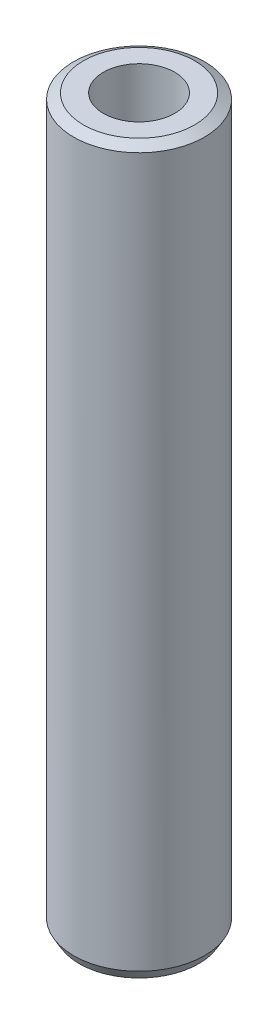
ISO-10303-21;
HEADER;
FILE_DESCRIPTION(('STEP AP214'),'2;1');
FILE_NAME('part.step','',(''),(''),'','','');
FILE_SCHEMA(('AUTOMOTIVE_DESIGN { 1 0 10303 214 1 1 1 1 }'));
ENDSEC;
DATA;
#1=APPLICATION_CONTEXT('core data for automotive mechanical design processes');
#2=APPLICATION_PROTOCOL_DEFINITION('international standard','automotive_design',2000,#1);
#3=PRODUCT_CONTEXT('',#1,'mechanical');
#4=PRODUCT('Part','Part','',(#3));
#5=PRODUCT_RELATED_PRODUCT_CATEGORY('part','',(#4));
#6=PRODUCT_DEFINITION_FORMATION('','',#4);
#7=PRODUCT_DEFINITION_CONTEXT('part definition',#1,'design');
#8=PRODUCT_DEFINITION('design','',#6,#7);
#9=PRODUCT_DEFINITION_SHAPE('','',#8);
#10=(LENGTH_UNIT() NAMED_UNIT(*) SI_UNIT(.MILLI.,.METRE.));
#11=(NAMED_UNIT(*) PLANE_ANGLE_UNIT() SI_UNIT($,.RADIAN.));
#12=(NAMED_UNIT(*) SI_UNIT($,.STERADIAN.) SOLID_ANGLE_UNIT());
#13=UNCERTAINTY_MEASURE_WITH_UNIT(LENGTH_MEASURE(1.E-05),#10,'distance_accuracy_value','');
#14=(GEOMETRIC_REPRESENTATION_CONTEXT(3) GLOBAL_UNCERTAINTY_ASSIGNED_CONTEXT((#13)) GLOBAL_UNIT_ASSIGNED_CONTEXT((#10,
#11,#12)) REPRESENTATION_CONTEXT('',''));
#15=CARTESIAN_POINT('',(0.,0.,0.));
#16=DIRECTION('',(0.,0.,1.));
#17=DIRECTION('',(1.,0.,0.));
#18=AXIS2_PLACEMENT_3D('',#15,#16,#17);
#19=CARTESIAN_POINT('',(0.,470.475245818461,0.));
#20=DIRECTION('',(0.,-1.,0.));
#21=DIRECTION('',(0.,0.,-1.));
#22=AXIS2_PLACEMENT_3D('',#19,#20,#21);
#23=CYLINDRICAL_SURFACE('',#22,42.5);
#24=CARTESIAN_POINT('',(0.,466.788189732393,0.));
#25=DIRECTION('',(0.,1.,0.));
#26=DIRECTION('',(0.,0.,1.));
#27=AXIS2_PLACEMENT_3D('',#24,#25,#26);
#28=CIRCLE('',#27,42.5);
#29=CARTESIAN_POINT('',(0.,466.788189732393,-42.5));
#30=VERTEX_POINT('',#29);
#31=EDGE_CURVE('E50',#30,#30,#28,.F.);
#32=CARTESIAN_POINT('',(0.,6.38616847142631,0.));
#33=DIRECTION('',(0.,1.,0.));
#34=DIRECTION('',(0.,0.,1.));
#35=AXIS2_PLACEMENT_3D('',#32,#33,#34);
#36=CIRCLE('',#35,42.5);
#37=CARTESIAN_POINT('',(0.,6.38616847142631,-42.5));
#38=VERTEX_POINT('',#37);
#39=EDGE_CURVE('E51',#38,#38,#36,.T.);
#40=CARTESIAN_POINT('',(0.,466.788189732393,-42.5));
#41=CARTESIAN_POINT('',(0.,461.992335344258,-42.5));
#42=CARTESIAN_POINT('',(0.,457.196480956123,-42.5));
#43=CARTESIAN_POINT('',(0.,447.604772179853,-42.5));
#44=CARTESIAN_POINT('',(0.,442.808917791718,-42.5));
#45=CARTESIAN_POINT('',(0.,433.217209015448,-42.5));
#46=CARTESIAN_POINT('',(0.,428.421354627313,-42.5));
#47=CARTESIAN_POINT('',(0.,418.829645851043,-42.5));
#48=CARTESIAN_POINT('',(0.,414.033791462907,-42.5));
#49=CARTESIAN_POINT('',(0.,404.442082686637,-42.5));
#50=CARTESIAN_POINT('',(0.,399.646228298502,-42.5));
#51=CARTESIAN_POINT('',(0.,390.054519522232,-42.5));
#52=CARTESIAN_POINT('',(0.,385.258665134097,-42.5));
#53=CARTESIAN_POINT('',(0.,375.666956357827,-42.5));
#54=CARTESIAN_POINT('',(0.,370.871101969692,-42.5));
#55=CARTESIAN_POINT('',(0.,361.279393193422,-42.5));
#56=CARTESIAN_POINT('',(0.,356.483538805287,-42.5));
#57=CARTESIAN_POINT('',(0.,346.891830029016,-42.5));
#58=CARTESIAN_POINT('',(0.,342.095975640881,-42.5));
#59=CARTESIAN_POINT('',(0.,332.504266864611,-42.5));
#60=CARTESIAN_POINT('',(0.,327.708412476476,-42.5));
#61=CARTESIAN_POINT('',(0.,318.116703700206,-42.5));
#62=CARTESIAN_POINT('',(0.,313.320849312071,-42.5));
#63=CARTESIAN_POINT('',(0.,303.729140535801,-42.5));
#64=CARTESIAN_POINT('',(0.,298.933286147666,-42.5));
#65=CARTESIAN_POINT('',(0.,289.341577371396,-42.5));
#66=CARTESIAN_POINT('',(0.,284.545722983261,-42.5));
#67=CARTESIAN_POINT('',(0.,274.95401420699,-42.5));
#68=CARTESIAN_POINT('',(0.,270.158159818855,-42.5));
#69=CARTESIAN_POINT('',(0.,260.566451042585,-42.5));
#70=CARTESIAN_POINT('',(0.,255.77059665445,-42.5));
#71=CARTESIAN_POINT('',(0.,246.17888787818,-42.5));
#72=CARTESIAN_POINT('',(0.,241.383033490045,-42.5));
#73=CARTESIAN_POINT('',(0.,231.791324713775,-42.5));
#74=CARTESIAN_POINT('',(0.,226.99547032564,-42.5));
#75=CARTESIAN_POINT('',(0.,217.40376154937,-42.5));
#76=CARTESIAN_POINT('',(0.,212.607907161234,-42.5));
#77=CARTESIAN_POINT('',(0.,203.016198384964,-42.5));
#78=CARTESIAN_POINT('',(0.,198.220343996829,-42.5));
#79=CARTESIAN_POINT('',(0.,188.628635220559,-42.5));
#80=CARTESIAN_POINT('',(0.,183.832780832424,-42.5));
#81=CARTESIAN_POINT('',(0.,174.241072056154,-42.5));
#82=CARTESIAN_POINT('',(0.,169.445217668019,-42.5));
#83=CARTESIAN_POINT('',(0.,159.853508891749,-42.5));
#84=CARTESIAN_POINT('',(0.,155.057654503614,-42.5));
#85=CARTESIAN_POINT('',(0.,145.465945727343,-42.5));
#86=CARTESIAN_POINT('',(0.,140.670091339208,-42.5));
#87=CARTESIAN_POINT('',(0.,131.078382562938,-42.5));
#88=CARTESIAN_POINT('',(0.,126.282528174803,-42.5));
#89=CARTESIAN_POINT('',(0.,116.690819398533,-42.5));
#90=CARTESIAN_POINT('',(0.,111.894965010398,-42.5));
#91=CARTESIAN_POINT('',(0.,102.303256234128,-42.5));
#92=CARTESIAN_POINT('',(0.,97.5074018459927,-42.5));
#93=CARTESIAN_POINT('',(0.,87.9156930697226,-42.5));
#94=CARTESIAN_POINT('',(0.,83.1198386815875,-42.5));
#95=CARTESIAN_POINT('',(0.,73.5281299053173,-42.5));
#96=CARTESIAN_POINT('',(0.,68.7322755171823,-42.5));
#97=CARTESIAN_POINT('',(0.,59.1405667409122,-42.5));
#98=CARTESIAN_POINT('',(0.,54.3447123527771,-42.5));
#99=CARTESIAN_POINT('',(0.,44.7530035765069,-42.5));
#100=CARTESIAN_POINT('',(0.,39.9571491883718,-42.5));
#101=CARTESIAN_POINT('',(0.,30.3654404121017,-42.5));
#102=CARTESIAN_POINT('',(0.,25.5695860239666,-42.5));
#103=CARTESIAN_POINT('',(0.,15.9778772476965,-42.5));
#104=CARTESIAN_POINT('',(0.,11.1820228595614,-42.5));
#105=CARTESIAN_POINT('',(0.,6.38616847142631,-42.5));
#106=B_SPLINE_CURVE_WITH_KNOTS('',3,(#40,#41,#42,#43,#44,#45,#46,#47,#48,#49,#50,#51,#52,#53,
#54,#55,#56,#57,#58,#59,#60,#61,#62,#63,#64,#65,#66,#67,#68,#69,#70,#71,#72,#73,#74,#75,#76,#77,
#78,#79,#80,#81,#82,#83,#84,#85,#86,#87,#88,#89,#90,#91,#92,#93,#94,#95,#96,#97,#98,#99,#100,
#101,#102,#103,#104,#105),.UNSPECIFIED.,.F.,.F.,(4,2,2,2,2,2,2,2,2,2,2,2,2,2,2,2,2,2,2,2,2,2,2,
2,2,2,2,2,2,2,2,2,4),(0.,14.3875631644053,28.7751263288105,43.1626894932157,57.5502526576209,
71.9378158220261,86.3253789864313,100.712942150837,115.100505315242,129.488068479647,
143.875631644052,158.263194808457,172.650757972863,187.038321137268,201.425884301673,
215.813447466078,230.201010630483,244.588573794889,258.976136959294,273.363700123699,
287.751263288104,302.13882645251,316.526389616915,330.91395278132,345.301515945725,
359.68907911013,374.076642274536,388.464205438941,402.851768603346,417.239331767751,
431.626894932157,446.014458096562,460.402021260967),.UNSPECIFIED.);
#107=EDGE_CURVE('BSEAM39',#30,#38,#106,.T.);
#108=ORIENTED_EDGE('',*,*,#31,.T.);
#109=ORIENTED_EDGE('',*,*,#39,.T.);
#110=ORIENTED_EDGE('',*,*,#107,.T.);
#111=ORIENTED_EDGE('',*,*,#107,.F.);
#112=EDGE_LOOP('',(#108,#110,#109,#111));
#113=FACE_BOUND('',#112,.T.);
#114=ADVANCED_FACE('F39',(#113),#23,.T.);
#115=CARTESIAN_POINT('',(0.,470.475245818461,0.));
#116=DIRECTION('',(0.,1.,0.));
#117=DIRECTION('',(0.,0.,1.));
#118=AXIS2_PLACEMENT_3D('',#115,#116,#117);
#119=PLANE('',#118);
#120=CARTESIAN_POINT('',(0.,470.475245818461,0.));
#121=DIRECTION('',(0.,1.,0.));
#122=DIRECTION('',(0.,0.,1.));
#123=AXIS2_PLACEMENT_3D('',#120,#121,#122);
#124=CIRCLE('',#123,36.1138315285747);
#125=CARTESIAN_POINT('',(0.,470.475245818461,36.1138315285747));
#126=VERTEX_POINT('',#125);
#127=EDGE_CURVE('E54',#126,#126,#124,.T.);
#128=ORIENTED_EDGE('',*,*,#127,.T.);
#129=EDGE_LOOP('',(#128));
#130=FACE_BOUND('',#129,.T.);
#131=CARTESIAN_POINT('',(0.,470.475245818461,0.));
#132=DIRECTION('',(0.,1.,0.));
#133=DIRECTION('',(0.,0.,1.));
#134=AXIS2_PLACEMENT_3D('',#131,#132,#133);
#135=CIRCLE('',#134,23.1758451578519);
#136=CARTESIAN_POINT('',(0.,470.475245818461,-23.1758451578519));
#137=VERTEX_POINT('',#136);
#138=EDGE_CURVE('E58',#137,#137,#135,.T.);
#139=ORIENTED_EDGE('',*,*,#138,.F.);
#140=EDGE_LOOP('',(#139));
#141=FACE_BOUND('',#140,.T.);
#142=ADVANCED_FACE('F69',(#130,#141),#119,.T.);
#143=CARTESIAN_POINT('',(0.,0.,0.));
#144=DIRECTION('',(0.,1.,0.));
#145=DIRECTION('',(0.,0.,1.));
#146=AXIS2_PLACEMENT_3D('',#143,#144,#145);
#147=PLANE('',#146);
#148=CARTESIAN_POINT('',(0.,0.,0.));
#149=DIRECTION('',(0.,1.,0.));
#150=DIRECTION('',(0.,0.,1.));
#151=AXIS2_PLACEMENT_3D('',#148,#149,#150);
#152=CIRCLE('',#151,38.8129439139317);
#153=CARTESIAN_POINT('',(0.,0.,38.8129439139317));
#154=VERTEX_POINT('',#153);
#155=EDGE_CURVE('E10',#154,#154,#152,.F.);
#156=ORIENTED_EDGE('',*,*,#155,.T.);
#157=EDGE_LOOP('',(#156));
#158=FACE_BOUND('',#157,.T.);
#159=CARTESIAN_POINT('',(0.,0.,0.));
#160=DIRECTION('',(0.,1.,0.));
#161=DIRECTION('',(0.,0.,1.));
#162=AXIS2_PLACEMENT_3D('',#159,#160,#161);
#163=CIRCLE('',#162,23.1758451578519);
#164=CARTESIAN_POINT('',(0.,0.,-23.1758451578519));
#165=VERTEX_POINT('',#164);
#166=EDGE_CURVE('E63',#165,#165,#163,.T.);
#167=ORIENTED_EDGE('',*,*,#166,.T.);
#168=EDGE_LOOP('',(#167));
#169=FACE_BOUND('',#168,.T.);
#170=ADVANCED_FACE('F75',(#158,#169),#147,.F.);
#171=CARTESIAN_POINT('',(0.,470.475245818461,0.));
#172=DIRECTION('',(0.,-1.,0.));
#173=DIRECTION('',(0.,0.,-1.));
#174=AXIS2_PLACEMENT_3D('',#171,#172,#173);
#175=CYLINDRICAL_SURFACE('',#174,23.1758451578519);
#176=CARTESIAN_POINT('',(0.,470.475245818461,-23.1758451578519));
#177=CARTESIAN_POINT('',(0.,465.574462007852,-23.1758451578519));
#178=CARTESIAN_POINT('',(0.,460.673678197243,-23.1758451578519));
#179=CARTESIAN_POINT('',(0.,450.872110576025,-23.1758451578519));
#180=CARTESIAN_POINT('',(0.,445.971326765416,-23.1758451578519));
#181=CARTESIAN_POINT('',(0.,436.169759144198,-23.1758451578519));
#182=CARTESIAN_POINT('',(0.,431.268975333589,-23.1758451578519));
#183=CARTESIAN_POINT('',(0.,421.467407712371,-23.1758451578519));
#184=CARTESIAN_POINT('',(0.,416.566623901762,-23.1758451578519));
#185=CARTESIAN_POINT('',(0.,406.765056280544,-23.1758451578519));
#186=CARTESIAN_POINT('',(0.,401.864272469935,-23.1758451578519));
#187=CARTESIAN_POINT('',(0.,392.062704848717,-23.1758451578519));
#188=CARTESIAN_POINT('',(0.,387.161921038109,-23.1758451578519));
#189=CARTESIAN_POINT('',(0.,377.360353416891,-23.1758451578519));
#190=CARTESIAN_POINT('',(0.,372.459569606282,-23.1758451578519));
#191=CARTESIAN_POINT('',(0.,362.658001985064,-23.1758451578519));
#192=CARTESIAN_POINT('',(0.,357.757218174455,-23.1758451578519));
#193=CARTESIAN_POINT('',(0.,347.955650553237,-23.1758451578519));
#194=CARTESIAN_POINT('',(0.,343.054866742628,-23.1758451578519));
#195=CARTESIAN_POINT('',(0.,333.25329912141,-23.1758451578519));
#196=CARTESIAN_POINT('',(0.,328.352515310801,-23.1758451578519));
#197=CARTESIAN_POINT('',(0.,318.550947689583,-23.1758451578519));
#198=CARTESIAN_POINT('',(0.,313.650163878974,-23.1758451578519));
#199=CARTESIAN_POINT('',(0.,303.848596257756,-23.1758451578519));
#200=CARTESIAN_POINT('',(0.,298.947812447147,-23.1758451578519));
#201=CARTESIAN_POINT('',(0.,289.146244825929,-23.1758451578519));
#202=CARTESIAN_POINT('',(0.,284.24546101532,-23.1758451578519));
#203=CARTESIAN_POINT('',(0.,274.443893394102,-23.1758451578519));
#204=CARTESIAN_POINT('',(0.,269.543109583493,-23.1758451578519));
#205=CARTESIAN_POINT('',(0.,259.741541962275,-23.1758451578519));
#206=CARTESIAN_POINT('',(0.,254.840758151666,-23.1758451578519));
#207=CARTESIAN_POINT('',(0.,245.039190530448,-23.1758451578519));
#208=CARTESIAN_POINT('',(0.,240.138406719839,-23.1758451578519));
#209=CARTESIAN_POINT('',(0.,230.336839098622,-23.1758451578519));
#210=CARTESIAN_POINT('',(0.,225.436055288013,-23.1758451578519));
#211=CARTESIAN_POINT('',(0.,215.634487666795,-23.1758451578519));
#212=CARTESIAN_POINT('',(0.,210.733703856186,-23.1758451578519));
#213=CARTESIAN_POINT('',(0.,200.932136234968,-23.1758451578519));
#214=CARTESIAN_POINT('',(0.,196.031352424359,-23.1758451578519));
#215=CARTESIAN_POINT('',(0.,186.229784803141,-23.1758451578519));
#216=CARTESIAN_POINT('',(0.,181.329000992532,-23.1758451578519));
#217=CARTESIAN_POINT('',(0.,171.527433371314,-23.1758451578519));
#218=CARTESIAN_POINT('',(0.,166.626649560705,-23.1758451578519));
#219=CARTESIAN_POINT('',(0.,156.825081939487,-23.1758451578519));
#220=CARTESIAN_POINT('',(0.,151.924298128878,-23.1758451578519));
#221=CARTESIAN_POINT('',(0.,142.12273050766,-23.1758451578519));
#222=CARTESIAN_POINT('',(0.,137.221946697051,-23.1758451578519));
#223=CARTESIAN_POINT('',(0.,127.420379075833,-23.1758451578519));
#224=CARTESIAN_POINT('',(0.,122.519595265224,-23.1758451578519));
#225=CARTESIAN_POINT('',(0.,112.718027644006,-23.1758451578519));
#226=CARTESIAN_POINT('',(0.,107.817243833397,-23.1758451578519));
#227=CARTESIAN_POINT('',(0.,98.0156762121793,-23.1758451578519));
#228=CARTESIAN_POINT('',(0.,93.1148924015704,-23.1758451578519));
#229=CARTESIAN_POINT('',(0.,83.3133247803524,-23.1758451578519));
#230=CARTESIAN_POINT('',(0.,78.4125409697435,-23.1758451578519));
#231=CARTESIAN_POINT('',(0.,68.6109733485255,-23.1758451578519));
#232=CARTESIAN_POINT('',(0.,63.7101895379166,-23.1758451578519));
#233=CARTESIAN_POINT('',(0.,53.9086219166986,-23.1758451578519));
#234=CARTESIAN_POINT('',(0.,49.0078381060896,-23.1758451578519));
#235=CARTESIAN_POINT('',(0.,39.2062704848717,-23.1758451578519));
#236=CARTESIAN_POINT('',(0.,34.3054866742627,-23.1758451578519));
#237=CARTESIAN_POINT('',(0.,24.5039190530448,-23.1758451578519));
#238=CARTESIAN_POINT('',(0.,19.6031352424358,-23.1758451578519));
#239=CARTESIAN_POINT('',(0.,9.80156762121788,-23.1758451578519));
#240=CARTESIAN_POINT('',(0.,4.90078381060891,-23.1758451578519));
#241=CARTESIAN_POINT('',(0.,0.,-23.1758451578519));
#242=B_SPLINE_CURVE_WITH_KNOTS('',3,(#176,#177,#178,#179,#180,#181,#182,#183,#184,#185,#186,
#187,#188,#189,#190,#191,#192,#193,#194,#195,#196,#197,#198,#199,#200,#201,#202,#203,#204,#205,
#206,#207,#208,#209,#210,#211,#212,#213,#214,#215,#216,#217,#218,#219,#220,#221,#222,#223,#224,
#225,#226,#227,#228,#229,#230,#231,#232,#233,#234,#235,#236,#237,#238,#239,#240,#241),
.UNSPECIFIED.,.F.,.F.,(4,2,2,2,2,2,2,2,2,2,2,2,2,2,2,2,2,2,2,2,2,2,2,2,2,2,2,2,2,2,2,2,4),(0.,
14.7023514318269,29.4047028636538,44.1070542954807,58.8094057273076,73.5117571591345,
88.2141085909614,102.916460022788,117.618811454615,132.321162886442,147.023514318269,
161.725865750096,176.428217181923,191.13056861375,205.832920045577,220.535271477404,
235.23762290923,249.939974341057,264.642325772884,279.344677204711,294.047028636538,
308.749380068365,323.451731500192,338.154082932019,352.856434363846,367.558785795673,
382.2611372275,396.963488659326,411.665840091153,426.36819152298,441.070542954807,
455.772894386634,470.475245818461),.UNSPECIFIED.);
#243=EDGE_CURVE('BSEAM70',#137,#165,#242,.T.);
#244=ORIENTED_EDGE('',*,*,#138,.T.);
#245=ORIENTED_EDGE('',*,*,#166,.F.);
#246=ORIENTED_EDGE('',*,*,#243,.T.);
#247=ORIENTED_EDGE('',*,*,#243,.F.);
#248=EDGE_LOOP('',(#244,#246,#245,#247));
#249=FACE_BOUND('',#248,.T.);
#250=ADVANCED_FACE('F70',(#249),#175,.F.);
#251=CARTESIAN_POINT('',(0.,470.475245818461,0.));
#252=DIRECTION('',(0.,-1.,0.));
#253=DIRECTION('',(0.,0.,-1.));
#254=AXIS2_PLACEMENT_3D('',#251,#252,#253);
#255=CONICAL_SURFACE('',#254,36.1138315285747,1.04719755119659);
#256=ORIENTED_EDGE('',*,*,#31,.F.);
#257=EDGE_LOOP('',(#256));
#258=FACE_BOUND('',#257,.T.);
#259=ORIENTED_EDGE('',*,*,#127,.F.);
#260=EDGE_LOOP('',(#259));
#261=FACE_BOUND('',#260,.T.);
#262=ADVANCED_FACE('F81',(#258,#261),#255,.T.);
#263=CARTESIAN_POINT('',(0.,6.38616847142631,0.));
#264=DIRECTION('',(0.,1.,0.));
#265=DIRECTION('',(0.,0.,1.));
#266=AXIS2_PLACEMENT_3D('',#263,#264,#265);
#267=CONICAL_SURFACE('',#266,42.5,0.523598775598307);
#268=ORIENTED_EDGE('',*,*,#155,.F.);
#269=EDGE_LOOP('',(#268));
#270=FACE_BOUND('',#269,.T.);
#271=ORIENTED_EDGE('',*,*,#39,.F.);
#272=EDGE_LOOP('',(#271));
#273=FACE_BOUND('',#272,.T.);
#274=ADVANCED_FACE('F45',(#270,#273),#267,.T.);
#275=CLOSED_SHELL('',(#114,#142,#170,#250,#262,#274));
#276=MANIFOLD_SOLID_BREP('B2',#275);
#277=ADVANCED_BREP_SHAPE_REPRESENTATION('',(#18,#276),#14);
#278=SHAPE_DEFINITION_REPRESENTATION(#9,#277);
ENDSEC;
END-ISO-10303-21;
